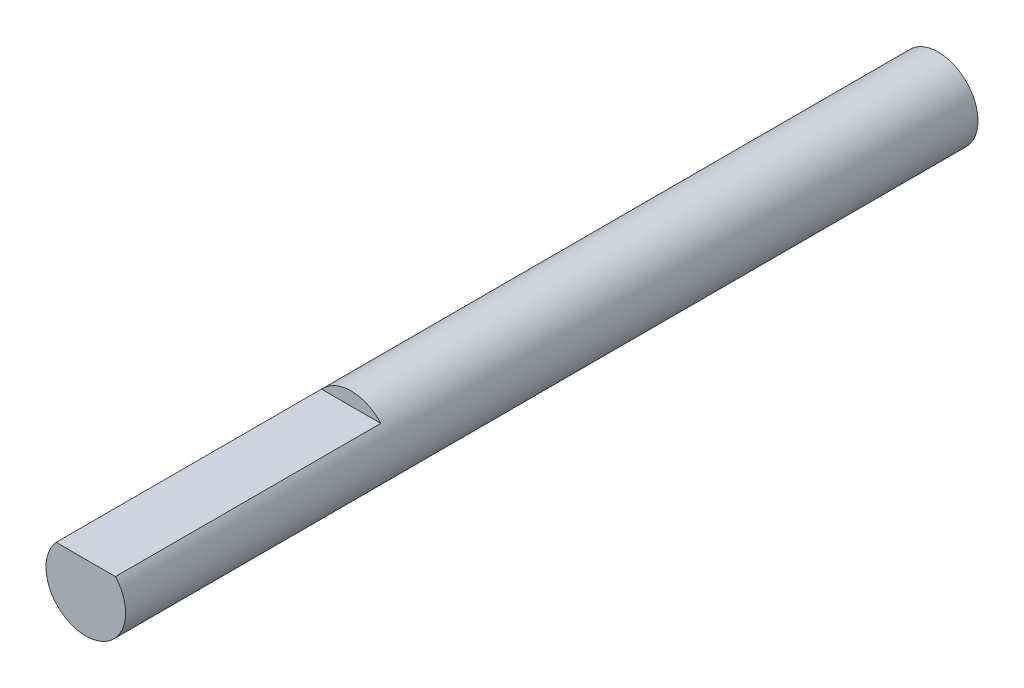
ISO-10303-21;
HEADER;
FILE_DESCRIPTION(('STEP AP214'),'2;1');
FILE_NAME('part.step','',(''),(''),'','','');
FILE_SCHEMA(('AUTOMOTIVE_DESIGN { 1 0 10303 214 1 1 1 1 }'));
ENDSEC;
DATA;
#1=APPLICATION_CONTEXT('core data for automotive mechanical design processes');
#2=APPLICATION_PROTOCOL_DEFINITION('international standard','automotive_design',2000,#1);
#3=PRODUCT_CONTEXT('',#1,'mechanical');
#4=PRODUCT('Part','Part','',(#3));
#5=PRODUCT_RELATED_PRODUCT_CATEGORY('part','',(#4));
#6=PRODUCT_DEFINITION_FORMATION('','',#4);
#7=PRODUCT_DEFINITION_CONTEXT('part definition',#1,'design');
#8=PRODUCT_DEFINITION('design','',#6,#7);
#9=PRODUCT_DEFINITION_SHAPE('','',#8);
#10=(LENGTH_UNIT() NAMED_UNIT(*) SI_UNIT(.MILLI.,.METRE.));
#11=(NAMED_UNIT(*) PLANE_ANGLE_UNIT() SI_UNIT($,.RADIAN.));
#12=(NAMED_UNIT(*) SI_UNIT($,.STERADIAN.) SOLID_ANGLE_UNIT());
#13=UNCERTAINTY_MEASURE_WITH_UNIT(LENGTH_MEASURE(1.E-05),#10,'distance_accuracy_value','');
#14=(GEOMETRIC_REPRESENTATION_CONTEXT(3) GLOBAL_UNCERTAINTY_ASSIGNED_CONTEXT((#13)) GLOBAL_UNIT_ASSIGNED_CONTEXT((#10,
#11,#12)) REPRESENTATION_CONTEXT('',''));
#15=CARTESIAN_POINT('',(0.,0.,0.));
#16=DIRECTION('',(0.,0.,1.));
#17=DIRECTION('',(1.,0.,0.));
#18=AXIS2_PLACEMENT_3D('',#15,#16,#17);
#19=CARTESIAN_POINT('',(0.,0.,16.0625));
#20=DIRECTION('',(0.,0.,-1.));
#21=DIRECTION('',(-1.,0.,0.));
#22=AXIS2_PLACEMENT_3D('',#19,#20,#21);
#23=CYLINDRICAL_SURFACE('',#22,1.5);
#24=CARTESIAN_POINT('',(0.,0.,16.0625));
#25=DIRECTION('',(0.,0.,1.));
#26=DIRECTION('',(1.,0.,0.));
#27=AXIS2_PLACEMENT_3D('',#24,#25,#26);
#28=CIRCLE('',#27,1.5);
#29=CARTESIAN_POINT('',(-1.1180339887499,1.,16.0625));
#30=VERTEX_POINT('',#29);
#31=CARTESIAN_POINT('',(1.1180339887499,1.,16.0625));
#32=VERTEX_POINT('',#31);
#33=EDGE_CURVE('E11',#30,#32,#28,.T.);
#34=ORIENTED_EDGE('',*,*,#33,.F.);
#35=DIRECTION('',(0.,0.,1.));
#36=VECTOR('',#35,1.);
#37=CARTESIAN_POINT('',(-1.1180339887499,1.,6.0625));
#38=LINE('',#37,#36);
#39=CARTESIAN_POINT('',(-1.1180339887499,1.,6.0625));
#40=VERTEX_POINT('',#39);
#41=EDGE_CURVE('E51',#40,#30,#38,.T.);
#42=ORIENTED_EDGE('',*,*,#41,.F.);
#43=CARTESIAN_POINT('',(0.,0.,6.0625));
#44=DIRECTION('',(0.,0.,1.));
#45=DIRECTION('',(-1.,0.,0.));
#46=AXIS2_PLACEMENT_3D('',#43,#44,#45);
#47=CIRCLE('',#46,1.50000000000005);
#48=CARTESIAN_POINT('',(1.1180339887499,1.,6.0625));
#49=VERTEX_POINT('',#48);
#50=EDGE_CURVE('E66',#49,#40,#47,.T.);
#51=ORIENTED_EDGE('',*,*,#50,.F.);
#52=DIRECTION('',(0.,0.,1.));
#53=VECTOR('',#52,1.);
#54=CARTESIAN_POINT('',(1.1180339887499,1.,6.0625));
#55=LINE('',#54,#53);
#56=EDGE_CURVE('E57',#49,#32,#55,.T.);
#57=ORIENTED_EDGE('',*,*,#56,.T.);
#58=EDGE_LOOP('',(#34,#42,#51,#57));
#59=FACE_BOUND('',#58,.T.);
#60=CARTESIAN_POINT('',(0.,0.,-16.0625));
#61=DIRECTION('',(0.,0.,1.));
#62=DIRECTION('',(1.,0.,0.));
#63=AXIS2_PLACEMENT_3D('',#60,#61,#62);
#64=CIRCLE('',#63,1.5);
#65=CARTESIAN_POINT('',(1.5,0.,-16.0625));
#66=VERTEX_POINT('',#65);
#67=EDGE_CURVE('E40',#66,#66,#64,.T.);
#68=ORIENTED_EDGE('',*,*,#67,.T.);
#69=EDGE_LOOP('',(#68));
#70=FACE_BOUND('',#69,.T.);
#71=ADVANCED_FACE('F37',(#59,#70),#23,.T.);
#72=CARTESIAN_POINT('',(0.,0.,16.0625));
#73=DIRECTION('',(0.,0.,1.));
#74=DIRECTION('',(1.,0.,0.));
#75=AXIS2_PLACEMENT_3D('',#72,#73,#74);
#76=PLANE('',#75);
#77=DIRECTION('',(1.,0.,0.));
#78=VECTOR('',#77,1.);
#79=CARTESIAN_POINT('',(1.1180339887499,1.,16.0625));
#80=LINE('',#79,#78);
#81=EDGE_CURVE('E62',#30,#32,#80,.T.);
#82=ORIENTED_EDGE('',*,*,#81,.F.);
#83=ORIENTED_EDGE('',*,*,#33,.T.);
#84=EDGE_LOOP('',(#82,#83));
#85=FACE_BOUND('',#84,.T.);
#86=ADVANCED_FACE('F72',(#85),#76,.T.);
#87=CARTESIAN_POINT('',(0.,0.,-16.0625));
#88=DIRECTION('',(0.,0.,1.));
#89=DIRECTION('',(1.,0.,0.));
#90=AXIS2_PLACEMENT_3D('',#87,#88,#89);
#91=PLANE('',#90);
#92=ORIENTED_EDGE('',*,*,#67,.F.);
#93=EDGE_LOOP('',(#92));
#94=FACE_BOUND('',#93,.T.);
#95=ADVANCED_FACE('F74',(#94),#91,.F.);
#96=CARTESIAN_POINT('',(1.1180339887499,1.,6.0625));
#97=DIRECTION('',(0.,-1.,0.));
#98=DIRECTION('',(0.,0.,-1.));
#99=AXIS2_PLACEMENT_3D('',#96,#97,#98);
#100=PLANE('',#99);
#101=ORIENTED_EDGE('',*,*,#81,.T.);
#102=ORIENTED_EDGE('',*,*,#56,.F.);
#103=DIRECTION('',(1.,0.,0.));
#104=VECTOR('',#103,1.);
#105=CARTESIAN_POINT('',(1.1180339887499,1.,6.0625));
#106=LINE('',#105,#104);
#107=EDGE_CURVE('E89',#40,#49,#106,.T.);
#108=ORIENTED_EDGE('',*,*,#107,.F.);
#109=ORIENTED_EDGE('',*,*,#41,.T.);
#110=EDGE_LOOP('',(#101,#102,#108,#109));
#111=FACE_BOUND('',#110,.T.);
#112=ADVANCED_FACE('F63',(#111),#100,.F.);
#113=CARTESIAN_POINT('',(0.,0.,6.0625));
#114=DIRECTION('',(0.,0.,-1.));
#115=DIRECTION('',(-1.,0.,0.));
#116=AXIS2_PLACEMENT_3D('',#113,#114,#115);
#117=PLANE('',#116);
#118=ORIENTED_EDGE('',*,*,#50,.T.);
#119=ORIENTED_EDGE('',*,*,#107,.T.);
#120=EDGE_LOOP('',(#118,#119));
#121=FACE_BOUND('',#120,.T.);
#122=ADVANCED_FACE('F84',(#121),#117,.F.);
#123=CLOSED_SHELL('',(#71,#86,#95,#112,#122));
#124=MANIFOLD_SOLID_BREP('B2',#123);
#125=ADVANCED_BREP_SHAPE_REPRESENTATION('',(#18,#124),#14);
#126=SHAPE_DEFINITION_REPRESENTATION(#9,#125);
ENDSEC;
END-ISO-10303-21;
